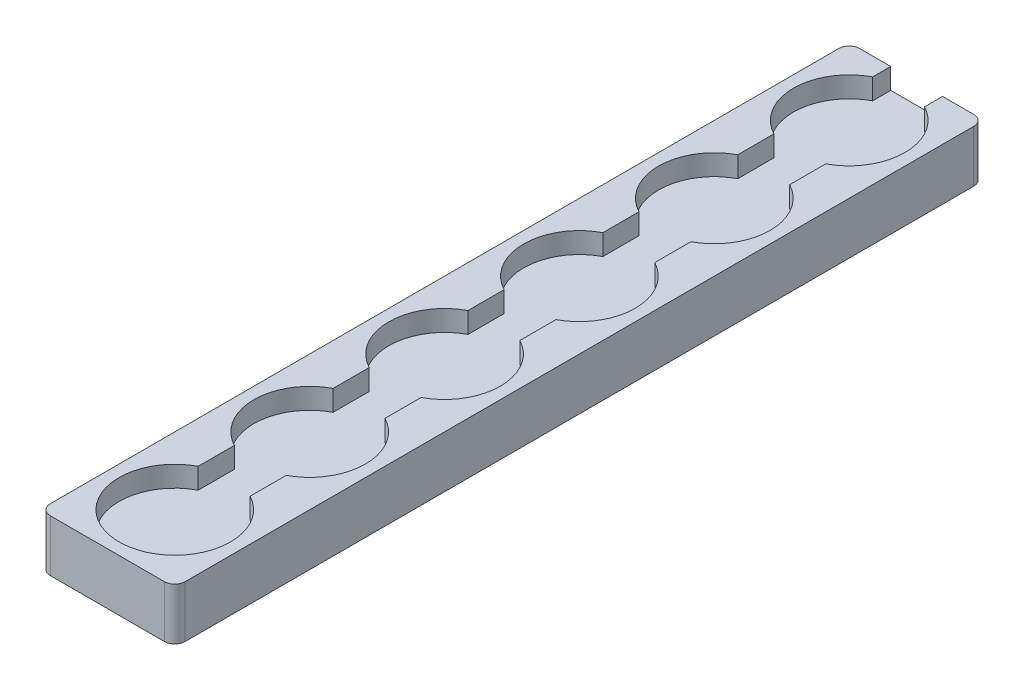
ISO-10303-21;
HEADER;
FILE_DESCRIPTION(('STEP AP214'),'2;1');
FILE_NAME('part.step','',(''),(''),'','','');
FILE_SCHEMA(('AUTOMOTIVE_DESIGN { 1 0 10303 214 1 1 1 1 }'));
ENDSEC;
DATA;
#1=APPLICATION_CONTEXT('core data for automotive mechanical design processes');
#2=APPLICATION_PROTOCOL_DEFINITION('international standard','automotive_design',2000,#1);
#3=PRODUCT_CONTEXT('',#1,'mechanical');
#4=PRODUCT('Part','Part','',(#3));
#5=PRODUCT_RELATED_PRODUCT_CATEGORY('part','',(#4));
#6=PRODUCT_DEFINITION_FORMATION('','',#4);
#7=PRODUCT_DEFINITION_CONTEXT('part definition',#1,'design');
#8=PRODUCT_DEFINITION('design','',#6,#7);
#9=PRODUCT_DEFINITION_SHAPE('','',#8);
#10=(LENGTH_UNIT() NAMED_UNIT(*) SI_UNIT(.MILLI.,.METRE.));
#11=(NAMED_UNIT(*) PLANE_ANGLE_UNIT() SI_UNIT($,.RADIAN.));
#12=(NAMED_UNIT(*) SI_UNIT($,.STERADIAN.) SOLID_ANGLE_UNIT());
#13=UNCERTAINTY_MEASURE_WITH_UNIT(LENGTH_MEASURE(1.E-05),#10,'distance_accuracy_value','');
#14=(GEOMETRIC_REPRESENTATION_CONTEXT(3) GLOBAL_UNCERTAINTY_ASSIGNED_CONTEXT((#13)) GLOBAL_UNIT_ASSIGNED_CONTEXT((#10,
#11,#12)) REPRESENTATION_CONTEXT('',''));
#15=CARTESIAN_POINT('',(0.,0.,0.));
#16=DIRECTION('',(0.,0.,1.));
#17=DIRECTION('',(1.,0.,0.));
#18=AXIS2_PLACEMENT_3D('',#15,#16,#17);
#19=CARTESIAN_POINT('',(0.,-4.,-130.));
#20=DIRECTION('',(0.,1.,0.));
#21=DIRECTION('',(0.,0.,1.));
#22=AXIS2_PLACEMENT_3D('',#19,#20,#21);
#23=CYLINDRICAL_SURFACE('',#22,10.75);
#24=CARTESIAN_POINT('',(0.,0.,-130.));
#25=DIRECTION('',(0.,1.,0.));
#26=DIRECTION('',(0.,0.,1.));
#27=AXIS2_PLACEMENT_3D('',#24,#25,#26);
#28=CIRCLE('',#27,10.75);
#29=CARTESIAN_POINT('',(-5.,0.,-139.516433155337));
#30=VERTEX_POINT('',#29);
#31=CARTESIAN_POINT('',(-5.,0.,-120.483566844663));
#32=VERTEX_POINT('',#31);
#33=EDGE_CURVE('E467',#30,#32,#28,.T.);
#34=ORIENTED_EDGE('',*,*,#33,.T.);
#35=DIRECTION('',(0.,1.,0.));
#36=VECTOR('',#35,1.);
#37=CARTESIAN_POINT('',(-5.,-4.,-120.483566844663));
#38=LINE('',#37,#36);
#39=CARTESIAN_POINT('',(-5.,-4.,-120.483566844663));
#40=VERTEX_POINT('',#39);
#41=EDGE_CURVE('E338',#32,#40,#38,.F.);
#42=ORIENTED_EDGE('',*,*,#41,.T.);
#43=CARTESIAN_POINT('',(0.,-4.,-130.));
#44=DIRECTION('',(0.,1.,0.));
#45=DIRECTION('',(0.,0.,1.));
#46=AXIS2_PLACEMENT_3D('',#43,#44,#45);
#47=CIRCLE('',#46,10.75);
#48=CARTESIAN_POINT('',(-5.,-4.,-139.516433155337));
#49=VERTEX_POINT('',#48);
#50=EDGE_CURVE('E463',#49,#40,#47,.T.);
#51=ORIENTED_EDGE('',*,*,#50,.F.);
#52=DIRECTION('',(0.,1.,0.));
#53=VECTOR('',#52,1.);
#54=CARTESIAN_POINT('',(-5.,-4.,-139.516433155337));
#55=LINE('',#54,#53);
#56=EDGE_CURVE('E422',#49,#30,#55,.T.);
#57=ORIENTED_EDGE('',*,*,#56,.T.);
#58=EDGE_LOOP('',(#34,#42,#51,#57));
#59=FACE_BOUND('',#58,.T.);
#60=ADVANCED_FACE('F38',(#59),#23,.F.);
#61=CARTESIAN_POINT('',(0.,-4.,-104.));
#62=DIRECTION('',(0.,1.,0.));
#63=DIRECTION('',(0.,0.,1.));
#64=AXIS2_PLACEMENT_3D('',#61,#62,#63);
#65=CYLINDRICAL_SURFACE('',#64,10.75);
#66=CARTESIAN_POINT('',(0.,0.,-104.));
#67=DIRECTION('',(0.,1.,0.));
#68=DIRECTION('',(0.,0.,1.));
#69=AXIS2_PLACEMENT_3D('',#66,#67,#68);
#70=CIRCLE('',#69,10.75);
#71=CARTESIAN_POINT('',(-5.,0.,-113.516433155337));
#72=VERTEX_POINT('',#71);
#73=CARTESIAN_POINT('',(-5.,0.,-94.4835668446629));
#74=VERTEX_POINT('',#73);
#75=EDGE_CURVE('E459',#72,#74,#70,.T.);
#76=ORIENTED_EDGE('',*,*,#75,.T.);
#77=DIRECTION('',(0.,1.,0.));
#78=VECTOR('',#77,1.);
#79=CARTESIAN_POINT('',(-5.,-4.,-94.4835668446629));
#80=LINE('',#79,#78);
#81=CARTESIAN_POINT('',(-5.,-4.,-94.4835668446629));
#82=VERTEX_POINT('',#81);
#83=EDGE_CURVE('E335',#74,#82,#80,.F.);
#84=ORIENTED_EDGE('',*,*,#83,.T.);
#85=CARTESIAN_POINT('',(0.,-4.,-104.));
#86=DIRECTION('',(0.,1.,0.));
#87=DIRECTION('',(0.,0.,1.));
#88=AXIS2_PLACEMENT_3D('',#85,#86,#87);
#89=CIRCLE('',#88,10.75);
#90=CARTESIAN_POINT('',(-5.,-4.,-113.516433155337));
#91=VERTEX_POINT('',#90);
#92=EDGE_CURVE('E455',#91,#82,#89,.T.);
#93=ORIENTED_EDGE('',*,*,#92,.F.);
#94=DIRECTION('',(0.,1.,0.));
#95=VECTOR('',#94,1.);
#96=CARTESIAN_POINT('',(-5.,-4.,-113.516433155337));
#97=LINE('',#96,#95);
#98=EDGE_CURVE('E398',#91,#72,#97,.T.);
#99=ORIENTED_EDGE('',*,*,#98,.T.);
#100=EDGE_LOOP('',(#76,#84,#93,#99));
#101=FACE_BOUND('',#100,.T.);
#102=ADVANCED_FACE('F604',(#101),#65,.F.);
#103=CARTESIAN_POINT('',(0.,-4.,-78.));
#104=DIRECTION('',(0.,1.,0.));
#105=DIRECTION('',(0.,0.,1.));
#106=AXIS2_PLACEMENT_3D('',#103,#104,#105);
#107=CYLINDRICAL_SURFACE('',#106,10.75);
#108=CARTESIAN_POINT('',(0.,0.,-78.));
#109=DIRECTION('',(0.,1.,0.));
#110=DIRECTION('',(0.,0.,1.));
#111=AXIS2_PLACEMENT_3D('',#108,#109,#110);
#112=CIRCLE('',#111,10.75);
#113=CARTESIAN_POINT('',(-5.,0.,-87.5164331553371));
#114=VERTEX_POINT('',#113);
#115=CARTESIAN_POINT('',(-5.,0.,-68.4835668446629));
#116=VERTEX_POINT('',#115);
#117=EDGE_CURVE('E451',#114,#116,#112,.T.);
#118=ORIENTED_EDGE('',*,*,#117,.T.);
#119=DIRECTION('',(0.,1.,0.));
#120=VECTOR('',#119,1.);
#121=CARTESIAN_POINT('',(-5.,-4.,-68.4835668446629));
#122=LINE('',#121,#120);
#123=CARTESIAN_POINT('',(-5.,-4.,-68.4835668446629));
#124=VERTEX_POINT('',#123);
#125=EDGE_CURVE('E332',#116,#124,#122,.F.);
#126=ORIENTED_EDGE('',*,*,#125,.T.);
#127=CARTESIAN_POINT('',(0.,-4.,-78.));
#128=DIRECTION('',(0.,1.,0.));
#129=DIRECTION('',(0.,0.,1.));
#130=AXIS2_PLACEMENT_3D('',#127,#128,#129);
#131=CIRCLE('',#130,10.75);
#132=CARTESIAN_POINT('',(-5.,-4.,-87.5164331553371));
#133=VERTEX_POINT('',#132);
#134=EDGE_CURVE('E447',#133,#124,#131,.T.);
#135=ORIENTED_EDGE('',*,*,#134,.F.);
#136=DIRECTION('',(0.,1.,0.));
#137=VECTOR('',#136,1.);
#138=CARTESIAN_POINT('',(-5.,-4.,-87.5164331553371));
#139=LINE('',#138,#137);
#140=EDGE_CURVE('E382',#133,#114,#139,.T.);
#141=ORIENTED_EDGE('',*,*,#140,.T.);
#142=EDGE_LOOP('',(#118,#126,#135,#141));
#143=FACE_BOUND('',#142,.T.);
#144=ADVANCED_FACE('F610',(#143),#107,.F.);
#145=CARTESIAN_POINT('',(0.,-4.,-52.));
#146=DIRECTION('',(0.,1.,0.));
#147=DIRECTION('',(0.,0.,1.));
#148=AXIS2_PLACEMENT_3D('',#145,#146,#147);
#149=CYLINDRICAL_SURFACE('',#148,10.75);
#150=CARTESIAN_POINT('',(0.,0.,-52.));
#151=DIRECTION('',(0.,1.,0.));
#152=DIRECTION('',(0.,0.,1.));
#153=AXIS2_PLACEMENT_3D('',#150,#151,#152);
#154=CIRCLE('',#153,10.75);
#155=CARTESIAN_POINT('',(-5.,0.,-61.5164331553371));
#156=VERTEX_POINT('',#155);
#157=CARTESIAN_POINT('',(-5.,0.,-42.4835668446629));
#158=VERTEX_POINT('',#157);
#159=EDGE_CURVE('E443',#156,#158,#154,.T.);
#160=ORIENTED_EDGE('',*,*,#159,.T.);
#161=DIRECTION('',(0.,1.,0.));
#162=VECTOR('',#161,1.);
#163=CARTESIAN_POINT('',(-5.,-4.,-42.4835668446629));
#164=LINE('',#163,#162);
#165=CARTESIAN_POINT('',(-5.,-4.,-42.4835668446629));
#166=VERTEX_POINT('',#165);
#167=EDGE_CURVE('E329',#158,#166,#164,.F.);
#168=ORIENTED_EDGE('',*,*,#167,.T.);
#169=CARTESIAN_POINT('',(0.,-4.,-52.));
#170=DIRECTION('',(0.,1.,0.));
#171=DIRECTION('',(0.,0.,1.));
#172=AXIS2_PLACEMENT_3D('',#169,#170,#171);
#173=CIRCLE('',#172,10.75);
#174=CARTESIAN_POINT('',(-5.,-4.,-61.5164331553371));
#175=VERTEX_POINT('',#174);
#176=EDGE_CURVE('E439',#175,#166,#173,.T.);
#177=ORIENTED_EDGE('',*,*,#176,.F.);
#178=DIRECTION('',(0.,1.,0.));
#179=VECTOR('',#178,1.);
#180=CARTESIAN_POINT('',(-5.,-4.,-61.5164331553371));
#181=LINE('',#180,#179);
#182=EDGE_CURVE('E366',#175,#156,#181,.T.);
#183=ORIENTED_EDGE('',*,*,#182,.T.);
#184=EDGE_LOOP('',(#160,#168,#177,#183));
#185=FACE_BOUND('',#184,.T.);
#186=ADVANCED_FACE('F678',(#185),#149,.F.);
#187=CARTESIAN_POINT('',(0.,-4.,-26.));
#188=DIRECTION('',(0.,1.,0.));
#189=DIRECTION('',(0.,0.,1.));
#190=AXIS2_PLACEMENT_3D('',#187,#188,#189);
#191=CYLINDRICAL_SURFACE('',#190,10.75);
#192=CARTESIAN_POINT('',(0.,0.,-26.));
#193=DIRECTION('',(0.,1.,0.));
#194=DIRECTION('',(0.,0.,1.));
#195=AXIS2_PLACEMENT_3D('',#192,#193,#194);
#196=CIRCLE('',#195,10.75);
#197=CARTESIAN_POINT('',(-5.,0.,-35.5164331553371));
#198=VERTEX_POINT('',#197);
#199=CARTESIAN_POINT('',(-5.,0.,-16.4835668446629));
#200=VERTEX_POINT('',#199);
#201=EDGE_CURVE('E435',#198,#200,#196,.T.);
#202=ORIENTED_EDGE('',*,*,#201,.T.);
#203=DIRECTION('',(0.,1.,0.));
#204=VECTOR('',#203,1.);
#205=CARTESIAN_POINT('',(-5.,-4.,-16.4835668446629));
#206=LINE('',#205,#204);
#207=CARTESIAN_POINT('',(-5.,-4.,-16.4835668446628));
#208=VERTEX_POINT('',#207);
#209=EDGE_CURVE('E326',#200,#208,#206,.F.);
#210=ORIENTED_EDGE('',*,*,#209,.T.);
#211=CARTESIAN_POINT('',(0.,-4.,-26.));
#212=DIRECTION('',(0.,1.,0.));
#213=DIRECTION('',(0.,0.,1.));
#214=AXIS2_PLACEMENT_3D('',#211,#212,#213);
#215=CIRCLE('',#214,10.75);
#216=CARTESIAN_POINT('',(-5.,-4.,-35.5164331553371));
#217=VERTEX_POINT('',#216);
#218=EDGE_CURVE('E430',#217,#208,#215,.T.);
#219=ORIENTED_EDGE('',*,*,#218,.F.);
#220=DIRECTION('',(0.,1.,0.));
#221=VECTOR('',#220,1.);
#222=CARTESIAN_POINT('',(-5.,-4.,-35.5164331553371));
#223=LINE('',#222,#221);
#224=EDGE_CURVE('E348',#217,#198,#223,.T.);
#225=ORIENTED_EDGE('',*,*,#224,.T.);
#226=EDGE_LOOP('',(#202,#210,#219,#225));
#227=FACE_BOUND('',#226,.T.);
#228=ADVANCED_FACE('F669',(#227),#191,.F.);
#229=CARTESIAN_POINT('',(0.,0.,0.));
#230=DIRECTION('',(0.,1.,0.));
#231=DIRECTION('',(0.,0.,1.));
#232=AXIS2_PLACEMENT_3D('',#229,#230,#231);
#233=PLANE('',#232);
#234=DIRECTION('',(0.,0.,-1.));
#235=VECTOR('',#234,1.);
#236=CARTESIAN_POINT('',(13.,0.,-13.));
#237=LINE('',#236,#235);
#238=CARTESIAN_POINT('',(13.,0.,11.));
#239=VERTEX_POINT('',#238);
#240=CARTESIAN_POINT('',(13.,0.,-141.));
#241=VERTEX_POINT('',#240);
#242=EDGE_CURVE('E500',#239,#241,#237,.T.);
#243=ORIENTED_EDGE('',*,*,#242,.T.);
#244=CARTESIAN_POINT('',(11.,0.,-141.));
#245=DIRECTION('',(0.,1.,0.));
#246=DIRECTION('',(0.,0.,1.));
#247=AXIS2_PLACEMENT_3D('',#244,#245,#246);
#248=CIRCLE('',#247,2.);
#249=CARTESIAN_POINT('',(11.,0.,-143.));
#250=VERTEX_POINT('',#249);
#251=EDGE_CURVE('E523',#241,#250,#248,.T.);
#252=ORIENTED_EDGE('',*,*,#251,.T.);
#253=DIRECTION('',(-1.,0.,0.));
#254=VECTOR('',#253,1.);
#255=CARTESIAN_POINT('',(-13.,0.,-143.));
#256=LINE('',#255,#254);
#257=CARTESIAN_POINT('',(5.,0.,-143.));
#258=VERTEX_POINT('',#257);
#259=EDGE_CURVE('E474',#250,#258,#256,.T.);
#260=ORIENTED_EDGE('',*,*,#259,.T.);
#261=DIRECTION('',(0.,0.,1.));
#262=VECTOR('',#261,1.);
#263=CARTESIAN_POINT('',(5.,0.,-143.));
#264=LINE('',#263,#262);
#265=CARTESIAN_POINT('',(5.,0.,-139.516433155337));
#266=VERTEX_POINT('',#265);
#267=EDGE_CURVE('E341',#258,#266,#264,.T.);
#268=ORIENTED_EDGE('',*,*,#267,.T.);
#269=CARTESIAN_POINT('',(4.99999999999999,0.,-120.483566844663));
#270=VERTEX_POINT('',#269);
#271=EDGE_CURVE('E359',#270,#266,#28,.T.);
#272=ORIENTED_EDGE('',*,*,#271,.F.);
#273=DIRECTION('',(0.,0.,1.));
#274=VECTOR('',#273,1.);
#275=CARTESIAN_POINT('',(5.,0.,-117.));
#276=LINE('',#275,#274);
#277=CARTESIAN_POINT('',(5.,0.,-113.516433155337));
#278=VERTEX_POINT('',#277);
#279=EDGE_CURVE('E399',#270,#278,#276,.T.);
#280=ORIENTED_EDGE('',*,*,#279,.T.);
#281=CARTESIAN_POINT('',(4.99999999999999,0.,-94.4835668446629));
#282=VERTEX_POINT('',#281);
#283=EDGE_CURVE('E462',#282,#278,#70,.T.);
#284=ORIENTED_EDGE('',*,*,#283,.F.);
#285=DIRECTION('',(0.,0.,1.));
#286=VECTOR('',#285,1.);
#287=CARTESIAN_POINT('',(5.,0.,-91.));
#288=LINE('',#287,#286);
#289=CARTESIAN_POINT('',(5.,0.,-87.5164331553371));
#290=VERTEX_POINT('',#289);
#291=EDGE_CURVE('E383',#282,#290,#288,.T.);
#292=ORIENTED_EDGE('',*,*,#291,.T.);
#293=CARTESIAN_POINT('',(4.99999999999999,0.,-68.4835668446629));
#294=VERTEX_POINT('',#293);
#295=EDGE_CURVE('E454',#294,#290,#112,.T.);
#296=ORIENTED_EDGE('',*,*,#295,.F.);
#297=DIRECTION('',(0.,0.,1.));
#298=VECTOR('',#297,1.);
#299=CARTESIAN_POINT('',(5.,0.,-65.));
#300=LINE('',#299,#298);
#301=CARTESIAN_POINT('',(5.,0.,-61.5164331553371));
#302=VERTEX_POINT('',#301);
#303=EDGE_CURVE('E367',#294,#302,#300,.T.);
#304=ORIENTED_EDGE('',*,*,#303,.T.);
#305=CARTESIAN_POINT('',(4.99999999999999,0.,-42.4835668446629));
#306=VERTEX_POINT('',#305);
#307=EDGE_CURVE('E446',#306,#302,#154,.T.);
#308=ORIENTED_EDGE('',*,*,#307,.F.);
#309=DIRECTION('',(0.,0.,1.));
#310=VECTOR('',#309,1.);
#311=CARTESIAN_POINT('',(5.,0.,-39.));
#312=LINE('',#311,#310);
#313=CARTESIAN_POINT('',(5.,0.,-35.5164331553371));
#314=VERTEX_POINT('',#313);
#315=EDGE_CURVE('E349',#306,#314,#312,.T.);
#316=ORIENTED_EDGE('',*,*,#315,.T.);
#317=CARTESIAN_POINT('',(4.99999999999999,0.,-16.4835668446628));
#318=VERTEX_POINT('',#317);
#319=EDGE_CURVE('E438',#318,#314,#196,.T.);
#320=ORIENTED_EDGE('',*,*,#319,.F.);
#321=DIRECTION('',(0.,0.,1.));
#322=VECTOR('',#321,1.);
#323=CARTESIAN_POINT('',(5.,0.,-13.));
#324=LINE('',#323,#322);
#325=CARTESIAN_POINT('',(5.,0.,-9.51643315533714));
#326=VERTEX_POINT('',#325);
#327=EDGE_CURVE('E473',#318,#326,#324,.T.);
#328=ORIENTED_EDGE('',*,*,#327,.T.);
#329=CARTESIAN_POINT('',(0.,0.,0.));
#330=DIRECTION('',(0.,1.,0.));
#331=DIRECTION('',(0.,0.,1.));
#332=AXIS2_PLACEMENT_3D('',#329,#330,#331);
#333=CIRCLE('',#332,10.75);
#334=CARTESIAN_POINT('',(-5.,0.,-9.51643315533714));
#335=VERTEX_POINT('',#334);
#336=EDGE_CURVE('E489',#335,#326,#333,.T.);
#337=ORIENTED_EDGE('',*,*,#336,.F.);
#338=DIRECTION('',(0.,0.,1.));
#339=VECTOR('',#338,1.);
#340=CARTESIAN_POINT('',(-5.,0.,-13.));
#341=LINE('',#340,#339);
#342=EDGE_CURVE('E479',#200,#335,#341,.T.);
#343=ORIENTED_EDGE('',*,*,#342,.F.);
#344=ORIENTED_EDGE('',*,*,#201,.F.);
#345=DIRECTION('',(0.,0.,1.));
#346=VECTOR('',#345,1.);
#347=CARTESIAN_POINT('',(-5.,0.,-39.));
#348=LINE('',#347,#346);
#349=EDGE_CURVE('E346',#158,#198,#348,.T.);
#350=ORIENTED_EDGE('',*,*,#349,.F.);
#351=ORIENTED_EDGE('',*,*,#159,.F.);
#352=DIRECTION('',(0.,0.,1.));
#353=VECTOR('',#352,1.);
#354=CARTESIAN_POINT('',(-5.,0.,-65.));
#355=LINE('',#354,#353);
#356=EDGE_CURVE('E364',#116,#156,#355,.T.);
#357=ORIENTED_EDGE('',*,*,#356,.F.);
#358=ORIENTED_EDGE('',*,*,#117,.F.);
#359=DIRECTION('',(0.,0.,1.));
#360=VECTOR('',#359,1.);
#361=CARTESIAN_POINT('',(-5.,0.,-91.));
#362=LINE('',#361,#360);
#363=EDGE_CURVE('E380',#74,#114,#362,.T.);
#364=ORIENTED_EDGE('',*,*,#363,.F.);
#365=ORIENTED_EDGE('',*,*,#75,.F.);
#366=DIRECTION('',(0.,0.,1.));
#367=VECTOR('',#366,1.);
#368=CARTESIAN_POINT('',(-5.,0.,-117.));
#369=LINE('',#368,#367);
#370=EDGE_CURVE('E396',#32,#72,#369,.T.);
#371=ORIENTED_EDGE('',*,*,#370,.F.);
#372=ORIENTED_EDGE('',*,*,#33,.F.);
#373=DIRECTION('',(0.,0.,1.));
#374=VECTOR('',#373,1.);
#375=CARTESIAN_POINT('',(-5.,0.,-143.));
#376=LINE('',#375,#374);
#377=CARTESIAN_POINT('',(-5.,0.,-143.));
#378=VERTEX_POINT('',#377);
#379=EDGE_CURVE('E412',#378,#30,#376,.T.);
#380=ORIENTED_EDGE('',*,*,#379,.F.);
#381=CARTESIAN_POINT('',(-11.,0.,-143.));
#382=VERTEX_POINT('',#381);
#383=EDGE_CURVE('E433',#378,#382,#256,.T.);
#384=ORIENTED_EDGE('',*,*,#383,.T.);
#385=CARTESIAN_POINT('',(-11.,0.,-141.));
#386=DIRECTION('',(0.,1.,0.));
#387=DIRECTION('',(0.,0.,1.));
#388=AXIS2_PLACEMENT_3D('',#385,#386,#387);
#389=CIRCLE('',#388,2.);
#390=CARTESIAN_POINT('',(-13.,0.,-141.));
#391=VERTEX_POINT('',#390);
#392=EDGE_CURVE('E517',#382,#391,#389,.T.);
#393=ORIENTED_EDGE('',*,*,#392,.T.);
#394=DIRECTION('',(0.,0.,1.));
#395=VECTOR('',#394,1.);
#396=CARTESIAN_POINT('',(-13.,0.,-13.));
#397=LINE('',#396,#395);
#398=CARTESIAN_POINT('',(-13.,0.,11.));
#399=VERTEX_POINT('',#398);
#400=EDGE_CURVE('E493',#391,#399,#397,.T.);
#401=ORIENTED_EDGE('',*,*,#400,.T.);
#402=CARTESIAN_POINT('',(-11.,0.,11.));
#403=DIRECTION('',(0.,1.,0.));
#404=DIRECTION('',(0.,0.,1.));
#405=AXIS2_PLACEMENT_3D('',#402,#403,#404);
#406=CIRCLE('',#405,2.);
#407=CARTESIAN_POINT('',(-11.,0.,13.));
#408=VERTEX_POINT('',#407);
#409=EDGE_CURVE('E519',#399,#408,#406,.T.);
#410=ORIENTED_EDGE('',*,*,#409,.T.);
#411=DIRECTION('',(1.,0.,0.));
#412=VECTOR('',#411,1.);
#413=CARTESIAN_POINT('',(-13.,0.,13.));
#414=LINE('',#413,#412);
#415=CARTESIAN_POINT('',(11.,0.,13.));
#416=VERTEX_POINT('',#415);
#417=EDGE_CURVE('E508',#408,#416,#414,.T.);
#418=ORIENTED_EDGE('',*,*,#417,.T.);
#419=CARTESIAN_POINT('',(11.,0.,11.));
#420=DIRECTION('',(0.,1.,0.));
#421=DIRECTION('',(0.,0.,1.));
#422=AXIS2_PLACEMENT_3D('',#419,#420,#421);
#423=CIRCLE('',#422,2.);
#424=EDGE_CURVE('E521',#416,#239,#423,.T.);
#425=ORIENTED_EDGE('',*,*,#424,.T.);
#426=EDGE_LOOP('',(#243,#252,#260,#268,#272,#280,#284,#292,#296,#304,#308,#316,#320,#328,#337,
#343,#344,#350,#351,#357,#358,#364,#365,#371,#372,#380,#384,#393,#401,#410,#418,#425));
#427=FACE_BOUND('',#426,.T.);
#428=ADVANCED_FACE('F561',(#427),#233,.T.);
#429=CARTESIAN_POINT('',(-13.,-10.,-143.));
#430=DIRECTION('',(0.,0.,-1.));
#431=DIRECTION('',(-1.,0.,0.));
#432=AXIS2_PLACEMENT_3D('',#429,#430,#431);
#433=PLANE('',#432);
#434=DIRECTION('',(0.,-1.,0.));
#435=VECTOR('',#434,1.);
#436=CARTESIAN_POINT('',(4.,-5.5,-143.));
#437=LINE('',#436,#435);
#438=CARTESIAN_POINT('',(4.,-5.5,-143.));
#439=VERTEX_POINT('',#438);
#440=CARTESIAN_POINT('',(4.,-8.5,-143.));
#441=VERTEX_POINT('',#440);
#442=EDGE_CURVE('E53',#439,#441,#437,.T.);
#443=ORIENTED_EDGE('',*,*,#442,.F.);
#444=DIRECTION('',(1.,0.,0.));
#445=VECTOR('',#444,1.);
#446=CARTESIAN_POINT('',(4.,-5.5,-143.));
#447=LINE('',#446,#445);
#448=CARTESIAN_POINT('',(-4.,-5.5,-143.));
#449=VERTEX_POINT('',#448);
#450=EDGE_CURVE('E293',#449,#439,#447,.T.);
#451=ORIENTED_EDGE('',*,*,#450,.F.);
#452=DIRECTION('',(0.,1.,0.));
#453=VECTOR('',#452,1.);
#454=CARTESIAN_POINT('',(-4.,-5.5,-143.));
#455=LINE('',#454,#453);
#456=CARTESIAN_POINT('',(-4.,-8.5,-143.));
#457=VERTEX_POINT('',#456);
#458=EDGE_CURVE('E296',#457,#449,#455,.T.);
#459=ORIENTED_EDGE('',*,*,#458,.F.);
#460=DIRECTION('',(-1.,0.,0.));
#461=VECTOR('',#460,1.);
#462=CARTESIAN_POINT('',(4.,-8.5,-143.));
#463=LINE('',#462,#461);
#464=EDGE_CURVE('E302',#441,#457,#463,.T.);
#465=ORIENTED_EDGE('',*,*,#464,.F.);
#466=EDGE_LOOP('',(#443,#451,#459,#465));
#467=FACE_BOUND('',#466,.T.);
#468=ORIENTED_EDGE('',*,*,#259,.F.);
#469=DIRECTION('',(0.,1.,0.));
#470=VECTOR('',#469,1.);
#471=CARTESIAN_POINT('',(11.,-10.,-143.));
#472=LINE('',#471,#470);
#473=CARTESIAN_POINT('',(11.,-10.,-143.));
#474=VERTEX_POINT('',#473);
#475=EDGE_CURVE('E528',#250,#474,#472,.F.);
#476=ORIENTED_EDGE('',*,*,#475,.T.);
#477=DIRECTION('',(-1.,0.,0.));
#478=VECTOR('',#477,1.);
#479=CARTESIAN_POINT('',(-13.,-10.,-143.));
#480=LINE('',#479,#478);
#481=CARTESIAN_POINT('',(-11.,-10.,-143.));
#482=VERTEX_POINT('',#481);
#483=EDGE_CURVE('E470',#474,#482,#480,.T.);
#484=ORIENTED_EDGE('',*,*,#483,.T.);
#485=DIRECTION('',(0.,1.,0.));
#486=VECTOR('',#485,1.);
#487=CARTESIAN_POINT('',(-11.,-10.,-143.));
#488=LINE('',#487,#486);
#489=EDGE_CURVE('E525',#482,#382,#488,.T.);
#490=ORIENTED_EDGE('',*,*,#489,.T.);
#491=ORIENTED_EDGE('',*,*,#383,.F.);
#492=DIRECTION('',(0.,1.,0.));
#493=VECTOR('',#492,1.);
#494=CARTESIAN_POINT('',(-5.,-4.,-143.));
#495=LINE('',#494,#493);
#496=CARTESIAN_POINT('',(-5.,-4.,-143.));
#497=VERTEX_POINT('',#496);
#498=EDGE_CURVE('E417',#497,#378,#495,.T.);
#499=ORIENTED_EDGE('',*,*,#498,.F.);
#500=DIRECTION('',(1.,0.,0.));
#501=VECTOR('',#500,1.);
#502=CARTESIAN_POINT('',(-5.,-4.,-143.));
#503=LINE('',#502,#501);
#504=CARTESIAN_POINT('',(5.,-4.,-143.));
#505=VERTEX_POINT('',#504);
#506=EDGE_CURVE('E408',#497,#505,#503,.T.);
#507=ORIENTED_EDGE('',*,*,#506,.T.);
#508=DIRECTION('',(0.,1.,0.));
#509=VECTOR('',#508,1.);
#510=CARTESIAN_POINT('',(5.,-4.,-143.));
#511=LINE('',#510,#509);
#512=EDGE_CURVE('E402',#505,#258,#511,.T.);
#513=ORIENTED_EDGE('',*,*,#512,.T.);
#514=EDGE_LOOP('',(#468,#476,#484,#490,#491,#499,#507,#513));
#515=FACE_BOUND('',#514,.T.);
#516=ADVANCED_FACE('F557',(#467,#515),#433,.T.);
#517=CARTESIAN_POINT('',(-13.,-10.,-13.));
#518=DIRECTION('',(-1.,0.,0.));
#519=DIRECTION('',(0.,0.,1.));
#520=AXIS2_PLACEMENT_3D('',#517,#518,#519);
#521=PLANE('',#520);
#522=DIRECTION('',(0.,0.,1.));
#523=VECTOR('',#522,1.);
#524=CARTESIAN_POINT('',(-13.,-10.,-13.));
#525=LINE('',#524,#523);
#526=CARTESIAN_POINT('',(-13.,-10.,-141.));
#527=VERTEX_POINT('',#526);
#528=CARTESIAN_POINT('',(-13.,-10.,11.));
#529=VERTEX_POINT('',#528);
#530=EDGE_CURVE('E496',#527,#529,#525,.T.);
#531=ORIENTED_EDGE('',*,*,#530,.T.);
#532=DIRECTION('',(0.,1.,0.));
#533=VECTOR('',#532,1.);
#534=CARTESIAN_POINT('',(-13.,-10.,11.));
#535=LINE('',#534,#533);
#536=EDGE_CURVE('E11',#529,#399,#535,.T.);
#537=ORIENTED_EDGE('',*,*,#536,.T.);
#538=ORIENTED_EDGE('',*,*,#400,.F.);
#539=DIRECTION('',(0.,1.,0.));
#540=VECTOR('',#539,1.);
#541=CARTESIAN_POINT('',(-13.,-10.,-141.));
#542=LINE('',#541,#540);
#543=EDGE_CURVE('E46',#391,#527,#542,.F.);
#544=ORIENTED_EDGE('',*,*,#543,.T.);
#545=EDGE_LOOP('',(#531,#537,#538,#544));
#546=FACE_BOUND('',#545,.T.);
#547=ADVANCED_FACE('F545',(#546),#521,.T.);
#548=CARTESIAN_POINT('',(13.,-10.,-13.));
#549=DIRECTION('',(1.,0.,0.));
#550=DIRECTION('',(0.,0.,-1.));
#551=AXIS2_PLACEMENT_3D('',#548,#549,#550);
#552=PLANE('',#551);
#553=DIRECTION('',(0.,0.,-1.));
#554=VECTOR('',#553,1.);
#555=CARTESIAN_POINT('',(13.,-10.,-13.));
#556=LINE('',#555,#554);
#557=CARTESIAN_POINT('',(13.,-10.,11.));
#558=VERTEX_POINT('',#557);
#559=CARTESIAN_POINT('',(13.,-10.,-141.));
#560=VERTEX_POINT('',#559);
#561=EDGE_CURVE('E502',#558,#560,#556,.T.);
#562=ORIENTED_EDGE('',*,*,#561,.T.);
#563=DIRECTION('',(0.,1.,0.));
#564=VECTOR('',#563,1.);
#565=CARTESIAN_POINT('',(13.,-10.,-141.));
#566=LINE('',#565,#564);
#567=EDGE_CURVE('E514',#560,#241,#566,.T.);
#568=ORIENTED_EDGE('',*,*,#567,.T.);
#569=ORIENTED_EDGE('',*,*,#242,.F.);
#570=DIRECTION('',(0.,1.,0.));
#571=VECTOR('',#570,1.);
#572=CARTESIAN_POINT('',(13.,-10.,11.));
#573=LINE('',#572,#571);
#574=EDGE_CURVE('E505',#239,#558,#573,.F.);
#575=ORIENTED_EDGE('',*,*,#574,.T.);
#576=EDGE_LOOP('',(#562,#568,#569,#575));
#577=FACE_BOUND('',#576,.T.);
#578=ADVANCED_FACE('F586',(#577),#552,.T.);
#579=CARTESIAN_POINT('',(-13.,-10.,13.));
#580=DIRECTION('',(0.,0.,1.));
#581=DIRECTION('',(1.,0.,0.));
#582=AXIS2_PLACEMENT_3D('',#579,#580,#581);
#583=PLANE('',#582);
#584=DIRECTION('',(1.,0.,0.));
#585=VECTOR('',#584,1.);
#586=CARTESIAN_POINT('',(-13.,-10.,13.));
#587=LINE('',#586,#585);
#588=CARTESIAN_POINT('',(-11.,-10.,13.));
#589=VERTEX_POINT('',#588);
#590=CARTESIAN_POINT('',(11.,-10.,13.));
#591=VERTEX_POINT('',#590);
#592=EDGE_CURVE('E499',#589,#591,#587,.T.);
#593=ORIENTED_EDGE('',*,*,#592,.T.);
#594=DIRECTION('',(0.,1.,0.));
#595=VECTOR('',#594,1.);
#596=CARTESIAN_POINT('',(11.,-10.,13.));
#597=LINE('',#596,#595);
#598=EDGE_CURVE('E539',#591,#416,#597,.T.);
#599=ORIENTED_EDGE('',*,*,#598,.T.);
#600=ORIENTED_EDGE('',*,*,#417,.F.);
#601=DIRECTION('',(0.,1.,0.));
#602=VECTOR('',#601,1.);
#603=CARTESIAN_POINT('',(-11.,-10.,13.));
#604=LINE('',#603,#602);
#605=EDGE_CURVE('E537',#408,#589,#604,.F.);
#606=ORIENTED_EDGE('',*,*,#605,.T.);
#607=EDGE_LOOP('',(#593,#599,#600,#606));
#608=FACE_BOUND('',#607,.T.);
#609=ADVANCED_FACE('F593',(#608),#583,.T.);
#610=CARTESIAN_POINT('',(0.,-10.,0.));
#611=DIRECTION('',(0.,1.,0.));
#612=DIRECTION('',(0.,0.,1.));
#613=AXIS2_PLACEMENT_3D('',#610,#611,#612);
#614=PLANE('',#613);
#615=ORIENTED_EDGE('',*,*,#483,.F.);
#616=CARTESIAN_POINT('',(11.,-10.,-141.));
#617=DIRECTION('',(0.,1.,0.));
#618=DIRECTION('',(0.,0.,1.));
#619=AXIS2_PLACEMENT_3D('',#616,#617,#618);
#620=CIRCLE('',#619,2.);
#621=EDGE_CURVE('E535',#474,#560,#620,.F.);
#622=ORIENTED_EDGE('',*,*,#621,.T.);
#623=ORIENTED_EDGE('',*,*,#561,.F.);
#624=CARTESIAN_POINT('',(11.,-10.,11.));
#625=DIRECTION('',(0.,1.,0.));
#626=DIRECTION('',(0.,0.,1.));
#627=AXIS2_PLACEMENT_3D('',#624,#625,#626);
#628=CIRCLE('',#627,2.);
#629=EDGE_CURVE('E61',#558,#591,#628,.F.);
#630=ORIENTED_EDGE('',*,*,#629,.T.);
#631=ORIENTED_EDGE('',*,*,#592,.F.);
#632=CARTESIAN_POINT('',(-11.,-10.,11.));
#633=DIRECTION('',(0.,1.,0.));
#634=DIRECTION('',(0.,0.,1.));
#635=AXIS2_PLACEMENT_3D('',#632,#633,#634);
#636=CIRCLE('',#635,2.);
#637=EDGE_CURVE('E532',#589,#529,#636,.F.);
#638=ORIENTED_EDGE('',*,*,#637,.T.);
#639=ORIENTED_EDGE('',*,*,#530,.F.);
#640=CARTESIAN_POINT('',(-11.,-10.,-141.));
#641=DIRECTION('',(0.,1.,0.));
#642=DIRECTION('',(0.,0.,1.));
#643=AXIS2_PLACEMENT_3D('',#640,#641,#642);
#644=CIRCLE('',#643,2.);
#645=EDGE_CURVE('E530',#527,#482,#644,.F.);
#646=ORIENTED_EDGE('',*,*,#645,.T.);
#647=EDGE_LOOP('',(#615,#622,#623,#630,#631,#638,#639,#646));
#648=FACE_BOUND('',#647,.T.);
#649=ADVANCED_FACE('F550',(#648),#614,.F.);
#650=CARTESIAN_POINT('',(0.,-4.,0.));
#651=DIRECTION('',(0.,1.,0.));
#652=DIRECTION('',(0.,0.,1.));
#653=AXIS2_PLACEMENT_3D('',#650,#651,#652);
#654=CYLINDRICAL_SURFACE('',#653,10.75);
#655=ORIENTED_EDGE('',*,*,#336,.T.);
#656=DIRECTION('',(0.,1.,0.));
#657=VECTOR('',#656,1.);
#658=CARTESIAN_POINT('',(5.,-4.,-9.51643315533714));
#659=LINE('',#658,#657);
#660=CARTESIAN_POINT('',(5.,-4.,-9.51643315533714));
#661=VERTEX_POINT('',#660);
#662=EDGE_CURVE('E487',#661,#326,#659,.T.);
#663=ORIENTED_EDGE('',*,*,#662,.F.);
#664=CARTESIAN_POINT('',(0.,-4.,0.));
#665=DIRECTION('',(0.,1.,0.));
#666=DIRECTION('',(0.,0.,1.));
#667=AXIS2_PLACEMENT_3D('',#664,#665,#666);
#668=CIRCLE('',#667,10.75);
#669=CARTESIAN_POINT('',(-5.,-4.,-9.51643315533714));
#670=VERTEX_POINT('',#669);
#671=EDGE_CURVE('E490',#670,#661,#668,.T.);
#672=ORIENTED_EDGE('',*,*,#671,.F.);
#673=DIRECTION('',(0.,1.,0.));
#674=VECTOR('',#673,1.);
#675=CARTESIAN_POINT('',(-5.,-4.,-9.51643315533714));
#676=LINE('',#675,#674);
#677=EDGE_CURVE('E481',#670,#335,#676,.T.);
#678=ORIENTED_EDGE('',*,*,#677,.T.);
#679=EDGE_LOOP('',(#655,#663,#672,#678));
#680=FACE_BOUND('',#679,.T.);
#681=ADVANCED_FACE('F663',(#680),#654,.F.);
#682=CARTESIAN_POINT('',(0.,-4.,0.));
#683=DIRECTION('',(0.,1.,0.));
#684=DIRECTION('',(0.,0.,1.));
#685=AXIS2_PLACEMENT_3D('',#682,#683,#684);
#686=PLANE('',#685);
#687=ORIENTED_EDGE('',*,*,#671,.T.);
#688=DIRECTION('',(0.,0.,1.));
#689=VECTOR('',#688,1.);
#690=CARTESIAN_POINT('',(5.,-4.,-13.));
#691=LINE('',#690,#689);
#692=CARTESIAN_POINT('',(4.99999999999999,-4.,-16.4835668446629));
#693=VERTEX_POINT('',#692);
#694=EDGE_CURVE('E476',#693,#661,#691,.T.);
#695=ORIENTED_EDGE('',*,*,#694,.F.);
#696=CARTESIAN_POINT('',(5.,-4.,-35.5164331553371));
#697=VERTEX_POINT('',#696);
#698=EDGE_CURVE('E434',#693,#697,#215,.T.);
#699=ORIENTED_EDGE('',*,*,#698,.T.);
#700=DIRECTION('',(0.,0.,1.));
#701=VECTOR('',#700,1.);
#702=CARTESIAN_POINT('',(5.,-4.,-39.));
#703=LINE('',#702,#701);
#704=CARTESIAN_POINT('',(4.99999999999999,-4.,-42.4835668446629));
#705=VERTEX_POINT('',#704);
#706=EDGE_CURVE('E342',#705,#697,#703,.T.);
#707=ORIENTED_EDGE('',*,*,#706,.F.);
#708=CARTESIAN_POINT('',(5.,-4.,-61.5164331553371));
#709=VERTEX_POINT('',#708);
#710=EDGE_CURVE('E442',#705,#709,#173,.T.);
#711=ORIENTED_EDGE('',*,*,#710,.T.);
#712=DIRECTION('',(0.,0.,1.));
#713=VECTOR('',#712,1.);
#714=CARTESIAN_POINT('',(5.,-4.,-65.));
#715=LINE('',#714,#713);
#716=CARTESIAN_POINT('',(4.99999999999999,-4.,-68.4835668446629));
#717=VERTEX_POINT('',#716);
#718=EDGE_CURVE('E360',#717,#709,#715,.T.);
#719=ORIENTED_EDGE('',*,*,#718,.F.);
#720=CARTESIAN_POINT('',(5.,-4.,-87.5164331553371));
#721=VERTEX_POINT('',#720);
#722=EDGE_CURVE('E450',#717,#721,#131,.T.);
#723=ORIENTED_EDGE('',*,*,#722,.T.);
#724=DIRECTION('',(0.,0.,1.));
#725=VECTOR('',#724,1.);
#726=CARTESIAN_POINT('',(5.,-4.,-91.));
#727=LINE('',#726,#725);
#728=CARTESIAN_POINT('',(4.99999999999999,-4.,-94.4835668446629));
#729=VERTEX_POINT('',#728);
#730=EDGE_CURVE('E376',#729,#721,#727,.T.);
#731=ORIENTED_EDGE('',*,*,#730,.F.);
#732=CARTESIAN_POINT('',(5.,-4.,-113.516433155337));
#733=VERTEX_POINT('',#732);
#734=EDGE_CURVE('E458',#729,#733,#89,.T.);
#735=ORIENTED_EDGE('',*,*,#734,.T.);
#736=DIRECTION('',(0.,0.,1.));
#737=VECTOR('',#736,1.);
#738=CARTESIAN_POINT('',(5.,-4.,-117.));
#739=LINE('',#738,#737);
#740=CARTESIAN_POINT('',(4.99999999999999,-4.,-120.483566844663));
#741=VERTEX_POINT('',#740);
#742=EDGE_CURVE('E392',#741,#733,#739,.T.);
#743=ORIENTED_EDGE('',*,*,#742,.F.);
#744=CARTESIAN_POINT('',(5.,-4.,-139.516433155337));
#745=VERTEX_POINT('',#744);
#746=EDGE_CURVE('E466',#741,#745,#47,.T.);
#747=ORIENTED_EDGE('',*,*,#746,.T.);
#748=DIRECTION('',(0.,0.,1.));
#749=VECTOR('',#748,1.);
#750=CARTESIAN_POINT('',(5.,-4.,-143.));
#751=LINE('',#750,#749);
#752=EDGE_CURVE('E411',#505,#745,#751,.T.);
#753=ORIENTED_EDGE('',*,*,#752,.F.);
#754=ORIENTED_EDGE('',*,*,#506,.F.);
#755=DIRECTION('',(0.,0.,1.));
#756=VECTOR('',#755,1.);
#757=CARTESIAN_POINT('',(-5.,-4.,-143.));
#758=LINE('',#757,#756);
#759=EDGE_CURVE('E415',#497,#49,#758,.T.);
#760=ORIENTED_EDGE('',*,*,#759,.T.);
#761=ORIENTED_EDGE('',*,*,#50,.T.);
#762=DIRECTION('',(0.,0.,1.));
#763=VECTOR('',#762,1.);
#764=CARTESIAN_POINT('',(-5.,-4.,-117.));
#765=LINE('',#764,#763);
#766=EDGE_CURVE('E395',#40,#91,#765,.T.);
#767=ORIENTED_EDGE('',*,*,#766,.T.);
#768=ORIENTED_EDGE('',*,*,#92,.T.);
#769=DIRECTION('',(0.,0.,1.));
#770=VECTOR('',#769,1.);
#771=CARTESIAN_POINT('',(-5.,-4.,-91.));
#772=LINE('',#771,#770);
#773=EDGE_CURVE('E379',#82,#133,#772,.T.);
#774=ORIENTED_EDGE('',*,*,#773,.T.);
#775=ORIENTED_EDGE('',*,*,#134,.T.);
#776=DIRECTION('',(0.,0.,1.));
#777=VECTOR('',#776,1.);
#778=CARTESIAN_POINT('',(-5.,-4.,-65.));
#779=LINE('',#778,#777);
#780=EDGE_CURVE('E363',#124,#175,#779,.T.);
#781=ORIENTED_EDGE('',*,*,#780,.T.);
#782=ORIENTED_EDGE('',*,*,#176,.T.);
#783=DIRECTION('',(0.,0.,1.));
#784=VECTOR('',#783,1.);
#785=CARTESIAN_POINT('',(-5.,-4.,-39.));
#786=LINE('',#785,#784);
#787=EDGE_CURVE('E345',#166,#217,#786,.T.);
#788=ORIENTED_EDGE('',*,*,#787,.T.);
#789=ORIENTED_EDGE('',*,*,#218,.T.);
#790=DIRECTION('',(0.,0.,1.));
#791=VECTOR('',#790,1.);
#792=CARTESIAN_POINT('',(-5.,-4.,-13.));
#793=LINE('',#792,#791);
#794=EDGE_CURVE('E478',#208,#670,#793,.T.);
#795=ORIENTED_EDGE('',*,*,#794,.T.);
#796=EDGE_LOOP('',(#687,#695,#699,#707,#711,#719,#723,#731,#735,#743,#747,#753,#754,#760,#761,
#767,#768,#774,#775,#781,#782,#788,#789,#795));
#797=FACE_BOUND('',#796,.T.);
#798=ADVANCED_FACE('F571',(#797),#686,.T.);
#799=CARTESIAN_POINT('',(5.,-4.,-13.));
#800=DIRECTION('',(-1.,0.,0.));
#801=DIRECTION('',(0.,0.,1.));
#802=AXIS2_PLACEMENT_3D('',#799,#800,#801);
#803=PLANE('',#802);
#804=ORIENTED_EDGE('',*,*,#327,.F.);
#805=DIRECTION('',(0.,1.,0.));
#806=VECTOR('',#805,1.);
#807=CARTESIAN_POINT('',(4.99999999999999,-4.,-16.4835668446629));
#808=LINE('',#807,#806);
#809=EDGE_CURVE('E308',#693,#318,#808,.T.);
#810=ORIENTED_EDGE('',*,*,#809,.F.);
#811=ORIENTED_EDGE('',*,*,#694,.T.);
#812=ORIENTED_EDGE('',*,*,#662,.T.);
#813=EDGE_LOOP('',(#804,#810,#811,#812));
#814=FACE_BOUND('',#813,.T.);
#815=ADVANCED_FACE('F624',(#814),#803,.T.);
#816=CARTESIAN_POINT('',(-5.,-4.,-13.));
#817=DIRECTION('',(-1.,0.,0.));
#818=DIRECTION('',(0.,0.,1.));
#819=AXIS2_PLACEMENT_3D('',#816,#817,#818);
#820=PLANE('',#819);
#821=ORIENTED_EDGE('',*,*,#342,.T.);
#822=ORIENTED_EDGE('',*,*,#677,.F.);
#823=ORIENTED_EDGE('',*,*,#794,.F.);
#824=ORIENTED_EDGE('',*,*,#209,.F.);
#825=EDGE_LOOP('',(#821,#822,#823,#824));
#826=FACE_BOUND('',#825,.T.);
#827=ADVANCED_FACE('F616',(#826),#820,.F.);
#828=ORIENTED_EDGE('',*,*,#746,.F.);
#829=DIRECTION('',(0.,1.,0.));
#830=VECTOR('',#829,1.);
#831=CARTESIAN_POINT('',(4.99999999999999,-4.,-120.483566844663));
#832=LINE('',#831,#830);
#833=EDGE_CURVE('E323',#741,#270,#832,.T.);
#834=ORIENTED_EDGE('',*,*,#833,.T.);
#835=ORIENTED_EDGE('',*,*,#271,.T.);
#836=DIRECTION('',(0.,1.,0.));
#837=VECTOR('',#836,1.);
#838=CARTESIAN_POINT('',(5.,-4.,-139.516433155337));
#839=LINE('',#838,#837);
#840=EDGE_CURVE('E425',#745,#266,#839,.T.);
#841=ORIENTED_EDGE('',*,*,#840,.F.);
#842=EDGE_LOOP('',(#828,#834,#835,#841));
#843=FACE_BOUND('',#842,.T.);
#844=ADVANCED_FACE('F606',(#843),#23,.F.);
#845=ORIENTED_EDGE('',*,*,#734,.F.);
#846=DIRECTION('',(0.,1.,0.));
#847=VECTOR('',#846,1.);
#848=CARTESIAN_POINT('',(4.99999999999999,-4.,-94.4835668446629));
#849=LINE('',#848,#847);
#850=EDGE_CURVE('E320',#729,#282,#849,.T.);
#851=ORIENTED_EDGE('',*,*,#850,.T.);
#852=ORIENTED_EDGE('',*,*,#283,.T.);
#853=DIRECTION('',(0.,1.,0.));
#854=VECTOR('',#853,1.);
#855=CARTESIAN_POINT('',(5.,-4.,-113.516433155337));
#856=LINE('',#855,#854);
#857=EDGE_CURVE('E386',#733,#278,#856,.T.);
#858=ORIENTED_EDGE('',*,*,#857,.F.);
#859=EDGE_LOOP('',(#845,#851,#852,#858));
#860=FACE_BOUND('',#859,.T.);
#861=ADVANCED_FACE('F613',(#860),#65,.F.);
#862=ORIENTED_EDGE('',*,*,#722,.F.);
#863=DIRECTION('',(0.,1.,0.));
#864=VECTOR('',#863,1.);
#865=CARTESIAN_POINT('',(4.99999999999999,-4.,-68.4835668446629));
#866=LINE('',#865,#864);
#867=EDGE_CURVE('E317',#717,#294,#866,.T.);
#868=ORIENTED_EDGE('',*,*,#867,.T.);
#869=ORIENTED_EDGE('',*,*,#295,.T.);
#870=DIRECTION('',(0.,1.,0.));
#871=VECTOR('',#870,1.);
#872=CARTESIAN_POINT('',(5.,-4.,-87.5164331553371));
#873=LINE('',#872,#871);
#874=EDGE_CURVE('E370',#721,#290,#873,.T.);
#875=ORIENTED_EDGE('',*,*,#874,.F.);
#876=EDGE_LOOP('',(#862,#868,#869,#875));
#877=FACE_BOUND('',#876,.T.);
#878=ADVANCED_FACE('F622',(#877),#107,.F.);
#879=ORIENTED_EDGE('',*,*,#710,.F.);
#880=DIRECTION('',(0.,1.,0.));
#881=VECTOR('',#880,1.);
#882=CARTESIAN_POINT('',(4.99999999999999,-4.,-42.4835668446629));
#883=LINE('',#882,#881);
#884=EDGE_CURVE('E314',#705,#306,#883,.T.);
#885=ORIENTED_EDGE('',*,*,#884,.T.);
#886=ORIENTED_EDGE('',*,*,#307,.T.);
#887=DIRECTION('',(0.,1.,0.));
#888=VECTOR('',#887,1.);
#889=CARTESIAN_POINT('',(5.,-4.,-61.5164331553371));
#890=LINE('',#889,#888);
#891=EDGE_CURVE('E352',#709,#302,#890,.T.);
#892=ORIENTED_EDGE('',*,*,#891,.F.);
#893=EDGE_LOOP('',(#879,#885,#886,#892));
#894=FACE_BOUND('',#893,.T.);
#895=ADVANCED_FACE('F648',(#894),#149,.F.);
#896=ORIENTED_EDGE('',*,*,#698,.F.);
#897=ORIENTED_EDGE('',*,*,#809,.T.);
#898=ORIENTED_EDGE('',*,*,#319,.T.);
#899=DIRECTION('',(0.,1.,0.));
#900=VECTOR('',#899,1.);
#901=CARTESIAN_POINT('',(5.,-4.,-35.5164331553371));
#902=LINE('',#901,#900);
#903=EDGE_CURVE('E356',#697,#314,#902,.T.);
#904=ORIENTED_EDGE('',*,*,#903,.F.);
#905=EDGE_LOOP('',(#896,#897,#898,#904));
#906=FACE_BOUND('',#905,.T.);
#907=ADVANCED_FACE('F657',(#906),#191,.F.);
#908=CARTESIAN_POINT('',(5.,-4.,-39.));
#909=DIRECTION('',(-1.,0.,0.));
#910=DIRECTION('',(0.,0.,1.));
#911=AXIS2_PLACEMENT_3D('',#908,#909,#910);
#912=PLANE('',#911);
#913=ORIENTED_EDGE('',*,*,#315,.F.);
#914=ORIENTED_EDGE('',*,*,#884,.F.);
#915=ORIENTED_EDGE('',*,*,#706,.T.);
#916=ORIENTED_EDGE('',*,*,#903,.T.);
#917=EDGE_LOOP('',(#913,#914,#915,#916));
#918=FACE_BOUND('',#917,.T.);
#919=ADVANCED_FACE('F651',(#918),#912,.T.);
#920=CARTESIAN_POINT('',(-5.,-4.,-39.));
#921=DIRECTION('',(-1.,0.,0.));
#922=DIRECTION('',(0.,0.,1.));
#923=AXIS2_PLACEMENT_3D('',#920,#921,#922);
#924=PLANE('',#923);
#925=ORIENTED_EDGE('',*,*,#349,.T.);
#926=ORIENTED_EDGE('',*,*,#224,.F.);
#927=ORIENTED_EDGE('',*,*,#787,.F.);
#928=ORIENTED_EDGE('',*,*,#167,.F.);
#929=EDGE_LOOP('',(#925,#926,#927,#928));
#930=FACE_BOUND('',#929,.T.);
#931=ADVANCED_FACE('F672',(#930),#924,.F.);
#932=CARTESIAN_POINT('',(5.,-4.,-65.));
#933=DIRECTION('',(-1.,0.,0.));
#934=DIRECTION('',(0.,0.,1.));
#935=AXIS2_PLACEMENT_3D('',#932,#933,#934);
#936=PLANE('',#935);
#937=ORIENTED_EDGE('',*,*,#303,.F.);
#938=ORIENTED_EDGE('',*,*,#867,.F.);
#939=ORIENTED_EDGE('',*,*,#718,.T.);
#940=ORIENTED_EDGE('',*,*,#891,.T.);
#941=EDGE_LOOP('',(#937,#938,#939,#940));
#942=FACE_BOUND('',#941,.T.);
#943=ADVANCED_FACE('F644',(#942),#936,.T.);
#944=CARTESIAN_POINT('',(-5.,-4.,-65.));
#945=DIRECTION('',(-1.,0.,0.));
#946=DIRECTION('',(0.,0.,1.));
#947=AXIS2_PLACEMENT_3D('',#944,#945,#946);
#948=PLANE('',#947);
#949=ORIENTED_EDGE('',*,*,#356,.T.);
#950=ORIENTED_EDGE('',*,*,#182,.F.);
#951=ORIENTED_EDGE('',*,*,#780,.F.);
#952=ORIENTED_EDGE('',*,*,#125,.F.);
#953=EDGE_LOOP('',(#949,#950,#951,#952));
#954=FACE_BOUND('',#953,.T.);
#955=ADVANCED_FACE('F682',(#954),#948,.F.);
#956=CARTESIAN_POINT('',(5.,-4.,-91.));
#957=DIRECTION('',(-1.,0.,0.));
#958=DIRECTION('',(0.,0.,1.));
#959=AXIS2_PLACEMENT_3D('',#956,#957,#958);
#960=PLANE('',#959);
#961=ORIENTED_EDGE('',*,*,#291,.F.);
#962=ORIENTED_EDGE('',*,*,#850,.F.);
#963=ORIENTED_EDGE('',*,*,#730,.T.);
#964=ORIENTED_EDGE('',*,*,#874,.T.);
#965=EDGE_LOOP('',(#961,#962,#963,#964));
#966=FACE_BOUND('',#965,.T.);
#967=ADVANCED_FACE('F637',(#966),#960,.T.);
#968=CARTESIAN_POINT('',(-5.,-4.,-91.));
#969=DIRECTION('',(-1.,0.,0.));
#970=DIRECTION('',(0.,0.,1.));
#971=AXIS2_PLACEMENT_3D('',#968,#969,#970);
#972=PLANE('',#971);
#973=ORIENTED_EDGE('',*,*,#363,.T.);
#974=ORIENTED_EDGE('',*,*,#140,.F.);
#975=ORIENTED_EDGE('',*,*,#773,.F.);
#976=ORIENTED_EDGE('',*,*,#83,.F.);
#977=EDGE_LOOP('',(#973,#974,#975,#976));
#978=FACE_BOUND('',#977,.T.);
#979=ADVANCED_FACE('F689',(#978),#972,.F.);
#980=CARTESIAN_POINT('',(5.,-4.,-117.));
#981=DIRECTION('',(-1.,0.,0.));
#982=DIRECTION('',(0.,0.,1.));
#983=AXIS2_PLACEMENT_3D('',#980,#981,#982);
#984=PLANE('',#983);
#985=ORIENTED_EDGE('',*,*,#279,.F.);
#986=ORIENTED_EDGE('',*,*,#833,.F.);
#987=ORIENTED_EDGE('',*,*,#742,.T.);
#988=ORIENTED_EDGE('',*,*,#857,.T.);
#989=EDGE_LOOP('',(#985,#986,#987,#988));
#990=FACE_BOUND('',#989,.T.);
#991=ADVANCED_FACE('F632',(#990),#984,.T.);
#992=CARTESIAN_POINT('',(-5.,-4.,-117.));
#993=DIRECTION('',(-1.,0.,0.));
#994=DIRECTION('',(0.,0.,1.));
#995=AXIS2_PLACEMENT_3D('',#992,#993,#994);
#996=PLANE('',#995);
#997=ORIENTED_EDGE('',*,*,#370,.T.);
#998=ORIENTED_EDGE('',*,*,#98,.F.);
#999=ORIENTED_EDGE('',*,*,#766,.F.);
#1000=ORIENTED_EDGE('',*,*,#41,.F.);
#1001=EDGE_LOOP('',(#997,#998,#999,#1000));
#1002=FACE_BOUND('',#1001,.T.);
#1003=ADVANCED_FACE('F692',(#1002),#996,.F.);
#1004=CARTESIAN_POINT('',(5.,-4.,-143.));
#1005=DIRECTION('',(-1.,0.,0.));
#1006=DIRECTION('',(0.,0.,1.));
#1007=AXIS2_PLACEMENT_3D('',#1004,#1005,#1006);
#1008=PLANE('',#1007);
#1009=ORIENTED_EDGE('',*,*,#267,.F.);
#1010=ORIENTED_EDGE('',*,*,#512,.F.);
#1011=ORIENTED_EDGE('',*,*,#752,.T.);
#1012=ORIENTED_EDGE('',*,*,#840,.T.);
#1013=EDGE_LOOP('',(#1009,#1010,#1011,#1012));
#1014=FACE_BOUND('',#1013,.T.);
#1015=ADVANCED_FACE('F577',(#1014),#1008,.T.);
#1016=CARTESIAN_POINT('',(-5.,-4.,-143.));
#1017=DIRECTION('',(-1.,0.,0.));
#1018=DIRECTION('',(0.,0.,1.));
#1019=AXIS2_PLACEMENT_3D('',#1016,#1017,#1018);
#1020=PLANE('',#1019);
#1021=ORIENTED_EDGE('',*,*,#379,.T.);
#1022=ORIENTED_EDGE('',*,*,#56,.F.);
#1023=ORIENTED_EDGE('',*,*,#759,.F.);
#1024=ORIENTED_EDGE('',*,*,#498,.T.);
#1025=EDGE_LOOP('',(#1021,#1022,#1023,#1024));
#1026=FACE_BOUND('',#1025,.T.);
#1027=ADVANCED_FACE('F565',(#1026),#1020,.F.);
#1028=CARTESIAN_POINT('',(11.,-10.,-141.));
#1029=DIRECTION('',(0.,1.,0.));
#1030=DIRECTION('',(0.,0.,1.));
#1031=AXIS2_PLACEMENT_3D('',#1028,#1029,#1030);
#1032=CYLINDRICAL_SURFACE('',#1031,2.);
#1033=ORIENTED_EDGE('',*,*,#621,.F.);
#1034=ORIENTED_EDGE('',*,*,#475,.F.);
#1035=ORIENTED_EDGE('',*,*,#251,.F.);
#1036=ORIENTED_EDGE('',*,*,#567,.F.);
#1037=EDGE_LOOP('',(#1033,#1034,#1035,#1036));
#1038=FACE_BOUND('',#1037,.T.);
#1039=ADVANCED_FACE('F584',(#1038),#1032,.T.);
#1040=CARTESIAN_POINT('',(11.,-10.,11.));
#1041=DIRECTION('',(0.,1.,0.));
#1042=DIRECTION('',(0.,0.,1.));
#1043=AXIS2_PLACEMENT_3D('',#1040,#1041,#1042);
#1044=CYLINDRICAL_SURFACE('',#1043,2.);
#1045=ORIENTED_EDGE('',*,*,#629,.F.);
#1046=ORIENTED_EDGE('',*,*,#574,.F.);
#1047=ORIENTED_EDGE('',*,*,#424,.F.);
#1048=ORIENTED_EDGE('',*,*,#598,.F.);
#1049=EDGE_LOOP('',(#1045,#1046,#1047,#1048));
#1050=FACE_BOUND('',#1049,.T.);
#1051=ADVANCED_FACE('F590',(#1050),#1044,.T.);
#1052=CARTESIAN_POINT('',(-11.,-10.,11.));
#1053=DIRECTION('',(0.,1.,0.));
#1054=DIRECTION('',(0.,0.,1.));
#1055=AXIS2_PLACEMENT_3D('',#1052,#1053,#1054);
#1056=CYLINDRICAL_SURFACE('',#1055,2.);
#1057=ORIENTED_EDGE('',*,*,#637,.F.);
#1058=ORIENTED_EDGE('',*,*,#605,.F.);
#1059=ORIENTED_EDGE('',*,*,#409,.F.);
#1060=ORIENTED_EDGE('',*,*,#536,.F.);
#1061=EDGE_LOOP('',(#1057,#1058,#1059,#1060));
#1062=FACE_BOUND('',#1061,.T.);
#1063=ADVANCED_FACE('F596',(#1062),#1056,.T.);
#1064=CARTESIAN_POINT('',(-11.,-10.,-141.));
#1065=DIRECTION('',(0.,1.,0.));
#1066=DIRECTION('',(0.,0.,1.));
#1067=AXIS2_PLACEMENT_3D('',#1064,#1065,#1066);
#1068=CYLINDRICAL_SURFACE('',#1067,2.);
#1069=ORIENTED_EDGE('',*,*,#645,.F.);
#1070=ORIENTED_EDGE('',*,*,#543,.F.);
#1071=ORIENTED_EDGE('',*,*,#392,.F.);
#1072=ORIENTED_EDGE('',*,*,#489,.F.);
#1073=EDGE_LOOP('',(#1069,#1070,#1071,#1072));
#1074=FACE_BOUND('',#1073,.T.);
#1075=ADVANCED_FACE('F40',(#1074),#1068,.T.);
#1076=CARTESIAN_POINT('',(4.,-5.5,-140.));
#1077=DIRECTION('',(1.,0.,0.));
#1078=DIRECTION('',(0.,1.,0.));
#1079=AXIS2_PLACEMENT_3D('',#1076,#1077,#1078);
#1080=PLANE('',#1079);
#1081=ORIENTED_EDGE('',*,*,#442,.T.);
#1082=DIRECTION('',(0.,0.,-1.));
#1083=VECTOR('',#1082,1.);
#1084=CARTESIAN_POINT('',(4.,-8.5,-140.));
#1085=LINE('',#1084,#1083);
#1086=CARTESIAN_POINT('',(4.,-8.5,-140.));
#1087=VERTEX_POINT('',#1086);
#1088=EDGE_CURVE('E271',#1087,#441,#1085,.T.);
#1089=ORIENTED_EDGE('',*,*,#1088,.F.);
#1090=DIRECTION('',(0.,-1.,0.));
#1091=VECTOR('',#1090,1.);
#1092=CARTESIAN_POINT('',(4.,-5.5,-140.));
#1093=LINE('',#1092,#1091);
#1094=CARTESIAN_POINT('',(4.,-5.5,-140.));
#1095=VERTEX_POINT('',#1094);
#1096=EDGE_CURVE('E275',#1095,#1087,#1093,.T.);
#1097=ORIENTED_EDGE('',*,*,#1096,.F.);
#1098=DIRECTION('',(0.,0.,-1.));
#1099=VECTOR('',#1098,1.);
#1100=CARTESIAN_POINT('',(4.,-5.5,-140.));
#1101=LINE('',#1100,#1099);
#1102=EDGE_CURVE('E306',#1095,#439,#1101,.T.);
#1103=ORIENTED_EDGE('',*,*,#1102,.T.);
#1104=EDGE_LOOP('',(#1081,#1089,#1097,#1103));
#1105=FACE_BOUND('',#1104,.T.);
#1106=ADVANCED_FACE('F273',(#1105),#1080,.F.);
#1107=CARTESIAN_POINT('',(4.,-5.5,-140.));
#1108=DIRECTION('',(0.,1.,0.));
#1109=DIRECTION('',(-1.,0.,0.));
#1110=AXIS2_PLACEMENT_3D('',#1107,#1108,#1109);
#1111=PLANE('',#1110);
#1112=ORIENTED_EDGE('',*,*,#450,.T.);
#1113=ORIENTED_EDGE('',*,*,#1102,.F.);
#1114=DIRECTION('',(1.,0.,0.));
#1115=VECTOR('',#1114,1.);
#1116=CARTESIAN_POINT('',(4.,-5.5,-140.));
#1117=LINE('',#1116,#1115);
#1118=CARTESIAN_POINT('',(-4.,-5.5,-140.));
#1119=VERTEX_POINT('',#1118);
#1120=EDGE_CURVE('E281',#1119,#1095,#1117,.T.);
#1121=ORIENTED_EDGE('',*,*,#1120,.F.);
#1122=DIRECTION('',(0.,0.,-1.));
#1123=VECTOR('',#1122,1.);
#1124=CARTESIAN_POINT('',(-4.,-5.5,-140.));
#1125=LINE('',#1124,#1123);
#1126=EDGE_CURVE('E309',#1119,#449,#1125,.T.);
#1127=ORIENTED_EDGE('',*,*,#1126,.T.);
#1128=EDGE_LOOP('',(#1112,#1113,#1121,#1127));
#1129=FACE_BOUND('',#1128,.T.);
#1130=ADVANCED_FACE('F774',(#1129),#1111,.F.);
#1131=CARTESIAN_POINT('',(-4.,-5.5,-140.));
#1132=DIRECTION('',(-1.,0.,0.));
#1133=DIRECTION('',(0.,-1.,0.));
#1134=AXIS2_PLACEMENT_3D('',#1131,#1132,#1133);
#1135=PLANE('',#1134);
#1136=ORIENTED_EDGE('',*,*,#458,.T.);
#1137=ORIENTED_EDGE('',*,*,#1126,.F.);
#1138=DIRECTION('',(0.,1.,0.));
#1139=VECTOR('',#1138,1.);
#1140=CARTESIAN_POINT('',(-4.,-5.5,-140.));
#1141=LINE('',#1140,#1139);
#1142=CARTESIAN_POINT('',(-4.,-8.5,-140.));
#1143=VERTEX_POINT('',#1142);
#1144=EDGE_CURVE('E289',#1143,#1119,#1141,.T.);
#1145=ORIENTED_EDGE('',*,*,#1144,.F.);
#1146=DIRECTION('',(0.,0.,-1.));
#1147=VECTOR('',#1146,1.);
#1148=CARTESIAN_POINT('',(-4.,-8.5,-140.));
#1149=LINE('',#1148,#1147);
#1150=EDGE_CURVE('E280',#1143,#457,#1149,.T.);
#1151=ORIENTED_EDGE('',*,*,#1150,.T.);
#1152=EDGE_LOOP('',(#1136,#1137,#1145,#1151));
#1153=FACE_BOUND('',#1152,.T.);
#1154=ADVANCED_FACE('F783',(#1153),#1135,.F.);
#1155=CARTESIAN_POINT('',(4.,-8.5,-140.));
#1156=DIRECTION('',(0.,-1.,0.));
#1157=DIRECTION('',(1.,0.,0.));
#1158=AXIS2_PLACEMENT_3D('',#1155,#1156,#1157);
#1159=PLANE('',#1158);
#1160=ORIENTED_EDGE('',*,*,#464,.T.);
#1161=ORIENTED_EDGE('',*,*,#1150,.F.);
#1162=DIRECTION('',(-1.,0.,0.));
#1163=VECTOR('',#1162,1.);
#1164=CARTESIAN_POINT('',(4.,-8.5,-140.));
#1165=LINE('',#1164,#1163);
#1166=EDGE_CURVE('E284',#1087,#1143,#1165,.T.);
#1167=ORIENTED_EDGE('',*,*,#1166,.F.);
#1168=ORIENTED_EDGE('',*,*,#1088,.T.);
#1169=EDGE_LOOP('',(#1160,#1161,#1167,#1168));
#1170=FACE_BOUND('',#1169,.T.);
#1171=ADVANCED_FACE('F285',(#1170),#1159,.F.);
#1172=CARTESIAN_POINT('',(0.,0.,-140.));
#1173=DIRECTION('',(0.,0.,-1.));
#1174=DIRECTION('',(-1.,0.,0.));
#1175=AXIS2_PLACEMENT_3D('',#1172,#1173,#1174);
#1176=PLANE('',#1175);
#1177=ORIENTED_EDGE('',*,*,#1096,.T.);
#1178=ORIENTED_EDGE('',*,*,#1166,.T.);
#1179=ORIENTED_EDGE('',*,*,#1144,.T.);
#1180=ORIENTED_EDGE('',*,*,#1120,.T.);
#1181=EDGE_LOOP('',(#1177,#1178,#1179,#1180));
#1182=FACE_BOUND('',#1181,.T.);
#1183=ADVANCED_FACE('F291',(#1182),#1176,.T.);
#1184=CLOSED_SHELL('',(#60,#102,#144,#186,#228,#428,#516,#547,#578,#609,#649,#681,#798,#815,
#827,#844,#861,#878,#895,#907,#919,#931,#943,#955,#967,#979,#991,#1003,#1015,#1027,#1039,#1051,
#1063,#1075,#1106,#1130,#1154,#1171,#1183));
#1185=MANIFOLD_SOLID_BREP('B2',#1184);
#1186=ADVANCED_BREP_SHAPE_REPRESENTATION('',(#18,#1185),#14);
#1187=SHAPE_DEFINITION_REPRESENTATION(#9,#1186);
ENDSEC;
END-ISO-10303-21;
